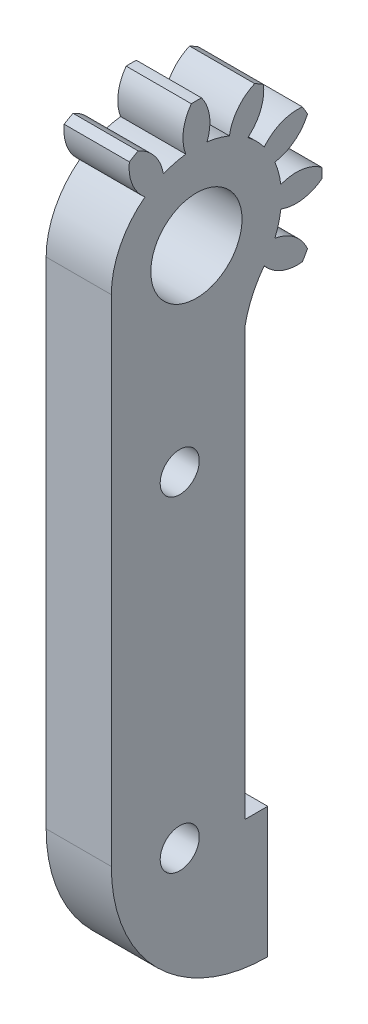
ISO-10303-21;
HEADER;
FILE_DESCRIPTION(('STEP AP214'),'2;1');
FILE_NAME('part.step','',(''),(''),'','','');
FILE_SCHEMA(('AUTOMOTIVE_DESIGN { 1 0 10303 214 1 1 1 1 }'));
ENDSEC;
DATA;
#1=APPLICATION_CONTEXT('core data for automotive mechanical design processes');
#2=APPLICATION_PROTOCOL_DEFINITION('international standard','automotive_design',2000,#1);
#3=PRODUCT_CONTEXT('',#1,'mechanical');
#4=PRODUCT('Part','Part','',(#3));
#5=PRODUCT_RELATED_PRODUCT_CATEGORY('part','',(#4));
#6=PRODUCT_DEFINITION_FORMATION('','',#4);
#7=PRODUCT_DEFINITION_CONTEXT('part definition',#1,'design');
#8=PRODUCT_DEFINITION('design','',#6,#7);
#9=PRODUCT_DEFINITION_SHAPE('','',#8);
#10=(LENGTH_UNIT() NAMED_UNIT(*) SI_UNIT(.MILLI.,.METRE.));
#11=(NAMED_UNIT(*) PLANE_ANGLE_UNIT() SI_UNIT($,.RADIAN.));
#12=(NAMED_UNIT(*) SI_UNIT($,.STERADIAN.) SOLID_ANGLE_UNIT());
#13=UNCERTAINTY_MEASURE_WITH_UNIT(LENGTH_MEASURE(1.E-05),#10,'distance_accuracy_value','');
#14=(GEOMETRIC_REPRESENTATION_CONTEXT(3) GLOBAL_UNCERTAINTY_ASSIGNED_CONTEXT((#13)) GLOBAL_UNIT_ASSIGNED_CONTEXT((#10,
#11,#12)) REPRESENTATION_CONTEXT('',''));
#15=CARTESIAN_POINT('',(0.,0.,0.));
#16=DIRECTION('',(0.,0.,1.));
#17=DIRECTION('',(1.,0.,0.));
#18=AXIS2_PLACEMENT_3D('',#15,#16,#17);
#19=CARTESIAN_POINT('',(5.,0.,0.));
#20=DIRECTION('',(-1.,0.,0.));
#21=DIRECTION('',(0.,-0.258819045102521,0.965925826289068));
#22=AXIS2_PLACEMENT_3D('',#19,#20,#21);
#23=CYLINDRICAL_SURFACE('',#22,6.53025);
#24=CARTESIAN_POINT('',(0.,0.,0.));
#25=DIRECTION('',(-1.,0.,0.));
#26=DIRECTION('',(0.,0.707106781186549,-0.707106781186546));
#27=AXIS2_PLACEMENT_3D('',#24,#25,#26);
#28=CIRCLE('',#27,6.53025);
#29=CARTESIAN_POINT('',(0.,0.,6.53025));
#30=VERTEX_POINT('',#29);
#31=CARTESIAN_POINT('',(0.,5.20307403430747,3.94616087558724));
#32=VERTEX_POINT('',#31);
#33=EDGE_CURVE('E249',#30,#32,#28,.T.);
#34=ORIENTED_EDGE('',*,*,#33,.F.);
#35=DIRECTION('',(1.,0.,0.));
#36=VECTOR('',#35,1.);
#37=CARTESIAN_POINT('',(-51.4198405287298,0.,6.53025));
#38=LINE('',#37,#36);
#39=CARTESIAN_POINT('',(5.,0.,6.53025));
#40=VERTEX_POINT('',#39);
#41=EDGE_CURVE('E235',#30,#40,#38,.T.);
#42=ORIENTED_EDGE('',*,*,#41,.T.);
#43=CARTESIAN_POINT('',(5.,0.,0.));
#44=DIRECTION('',(-1.,0.,0.));
#45=DIRECTION('',(0.,0.707106781186549,-0.707106781186546));
#46=AXIS2_PLACEMENT_3D('',#43,#44,#45);
#47=CIRCLE('',#46,6.53025);
#48=CARTESIAN_POINT('',(5.,5.20307403430747,3.94616087558724));
#49=VERTEX_POINT('',#48);
#50=EDGE_CURVE('E247',#40,#49,#47,.T.);
#51=ORIENTED_EDGE('',*,*,#50,.T.);
#52=DIRECTION('',(-1.,0.,0.));
#53=VECTOR('',#52,1.);
#54=CARTESIAN_POINT('',(5.,5.20307403430747,3.94616087558724));
#55=LINE('',#54,#53);
#56=EDGE_CURVE('E255',#49,#32,#55,.T.);
#57=ORIENTED_EDGE('',*,*,#56,.T.);
#58=EDGE_LOOP('',(#34,#42,#51,#57));
#59=FACE_BOUND('',#58,.T.);
#60=ADVANCED_FACE('F32',(#59),#23,.T.);
#61=CARTESIAN_POINT('',(5.,0.,0.));
#62=DIRECTION('',(-1.,0.,0.));
#63=DIRECTION('',(0.,-0.258819045102521,0.965925826289068));
#64=AXIS2_PLACEMENT_3D('',#61,#62,#63);
#65=PLANE('',#64);
#66=CARTESIAN_POINT('',(5.,-39.4107973671076,1.28025));
#67=DIRECTION('',(-1.,0.,0.));
#68=DIRECTION('',(0.,0.,1.));
#69=AXIS2_PLACEMENT_3D('',#66,#67,#68);
#70=CIRCLE('',#69,1.5);
#71=CARTESIAN_POINT('',(5.,-39.4107973671076,2.78025));
#72=VERTEX_POINT('',#71);
#73=EDGE_CURVE('E726',#72,#72,#70,.T.);
#74=ORIENTED_EDGE('',*,*,#73,.T.);
#75=EDGE_LOOP('',(#74));
#76=FACE_BOUND('',#75,.T.);
#77=CARTESIAN_POINT('',(5.,-14.4107973671076,1.28025));
#78=DIRECTION('',(-1.,0.,0.));
#79=DIRECTION('',(0.,0.,1.));
#80=AXIS2_PLACEMENT_3D('',#77,#78,#79);
#81=CIRCLE('',#80,1.50000000000002);
#82=CARTESIAN_POINT('',(5.,-14.4107973671076,2.78025000000002));
#83=VERTEX_POINT('',#82);
#84=EDGE_CURVE('E730',#83,#83,#81,.T.);
#85=ORIENTED_EDGE('',*,*,#84,.T.);
#86=EDGE_LOOP('',(#85));
#87=FACE_BOUND('',#86,.T.);
#88=CARTESIAN_POINT('',(5.,0.,0.));
#89=DIRECTION('',(1.,0.,0.));
#90=DIRECTION('',(0.,0.,-1.));
#91=AXIS2_PLACEMENT_3D('',#88,#89,#90);
#92=CIRCLE('',#91,3.5);
#93=CARTESIAN_POINT('',(5.,0.,-3.5));
#94=VERTEX_POINT('',#93);
#95=EDGE_CURVE('E732',#94,#94,#92,.T.);
#96=ORIENTED_EDGE('',*,*,#95,.F.);
#97=EDGE_LOOP('',(#96));
#98=FACE_BOUND('',#97,.T.);
#99=ORIENTED_EDGE('',*,*,#50,.F.);
#100=DIRECTION('',(0.,-1.,0.));
#101=VECTOR('',#100,1.);
#102=CARTESIAN_POINT('',(5.,0.,6.53025));
#103=LINE('',#102,#101);
#104=CARTESIAN_POINT('',(5.,-38.,6.53025));
#105=VERTEX_POINT('',#104);
#106=EDGE_CURVE('E231',#40,#105,#103,.T.);
#107=ORIENTED_EDGE('',*,*,#106,.T.);
#108=CARTESIAN_POINT('',(5.,-38.,-5.46975));
#109=DIRECTION('',(1.,0.,0.));
#110=DIRECTION('',(0.,0.,-1.));
#111=AXIS2_PLACEMENT_3D('',#108,#109,#110);
#112=CIRCLE('',#111,12.);
#113=CARTESIAN_POINT('',(5.,-50.,-5.46975));
#114=VERTEX_POINT('',#113);
#115=EDGE_CURVE('E243',#105,#114,#112,.T.);
#116=ORIENTED_EDGE('',*,*,#115,.T.);
#117=DIRECTION('',(0.,1.,0.));
#118=VECTOR('',#117,1.);
#119=CARTESIAN_POINT('',(5.,-50.,-5.46975));
#120=LINE('',#119,#118);
#121=CARTESIAN_POINT('',(5.,-40.,-5.46975));
#122=VERTEX_POINT('',#121);
#123=EDGE_CURVE('E750',#114,#122,#120,.T.);
#124=ORIENTED_EDGE('',*,*,#123,.T.);
#125=DIRECTION('',(0.,0.,1.));
#126=VECTOR('',#125,1.);
#127=CARTESIAN_POINT('',(5.,-40.,-5.46975));
#128=LINE('',#127,#126);
#129=CARTESIAN_POINT('',(5.,-40.,-3.71975));
#130=VERTEX_POINT('',#129);
#131=EDGE_CURVE('E753',#122,#130,#128,.T.);
#132=ORIENTED_EDGE('',*,*,#131,.T.);
#133=DIRECTION('',(0.,1.,0.));
#134=VECTOR('',#133,1.);
#135=CARTESIAN_POINT('',(5.,-40.,-3.71975));
#136=LINE('',#135,#134);
#137=CARTESIAN_POINT('',(5.,-7.27695193070972,-3.71975000000001));
#138=VERTEX_POINT('',#137);
#139=EDGE_CURVE('E756',#130,#138,#136,.T.);
#140=ORIENTED_EDGE('',*,*,#139,.T.);
#141=CARTESIAN_POINT('',(5.,-8.78047610160418,-11.5771932907617));
#142=DIRECTION('',(-1.,0.,0.));
#143=DIRECTION('',(0.,0.,-1.));
#144=AXIS2_PLACEMENT_3D('',#141,#142,#143);
#145=CIRCLE('',#144,8.);
#146=CARTESIAN_POINT('',(5.,-3.94616087558718,-5.20307403430751));
#147=VERTEX_POINT('',#146);
#148=EDGE_CURVE('E250',#138,#147,#145,.T.);
#149=ORIENTED_EDGE('',*,*,#148,.T.);
#150=CARTESIAN_POINT('',(5.,-1.86722961459183,-7.76589373379014));
#151=DIRECTION('',(-1.,0.,0.));
#152=DIRECTION('',(0.,-0.707106781186554,0.707106781186541));
#153=AXIS2_PLACEMENT_3D('',#150,#151,#152);
#154=CIRCLE('',#153,3.3);
#155=CARTESIAN_POINT('',(5.,-5.14670283362097,-8.13339258504088));
#156=VERTEX_POINT('',#155);
#157=EDGE_CURVE('E372',#156,#147,#154,.T.);
#158=ORIENTED_EDGE('',*,*,#157,.F.);
#159=CARTESIAN_POINT('',(5.,0.,0.));
#160=DIRECTION('',(-1.,0.,0.));
#161=DIRECTION('',(0.,-0.258819045102521,0.965925826289068));
#162=AXIS2_PLACEMENT_3D('',#159,#160,#161);
#163=CIRCLE('',#162,9.625);
#164=CARTESIAN_POINT('',(5.,-4.47037318078674,-8.52387169216564));
#165=VERTEX_POINT('',#164);
#166=EDGE_CURVE('E302',#165,#156,#163,.T.);
#167=ORIENTED_EDGE('',*,*,#166,.F.);
#168=CARTESIAN_POINT('',(5.,-5.79184644925663,-5.50001514783033));
#169=DIRECTION('',(-1.,0.,0.));
#170=DIRECTION('',(0.,-0.965925826289071,0.258819045102511));
#171=AXIS2_PLACEMENT_3D('',#168,#169,#170);
#172=CIRCLE('',#171,3.3);
#173=CARTESIAN_POINT('',(5.,-2.53291385368778,-6.01901258283255));
#174=VERTEX_POINT('',#173);
#175=EDGE_CURVE('E369',#174,#165,#172,.T.);
#176=ORIENTED_EDGE('',*,*,#175,.F.);
#177=CARTESIAN_POINT('',(5.,0.,0.));
#178=DIRECTION('',(-1.,0.,0.));
#179=DIRECTION('',(0.,-0.965925826289071,0.258819045102511));
#180=AXIS2_PLACEMENT_3D('',#177,#178,#179);
#181=CIRCLE('',#180,6.53025);
#182=CARTESIAN_POINT('',(5.,-0.815938548524985,-6.47907472927508));
#183=VERTEX_POINT('',#182);
#184=EDGE_CURVE('E457',#183,#174,#181,.T.);
#185=ORIENTED_EDGE('',*,*,#184,.F.);
#186=CARTESIAN_POINT('',(5.,2.26587858595993,-7.65907606384856));
#187=DIRECTION('',(-1.,0.,0.));
#188=DIRECTION('',(0.,-0.965925826289071,0.258819045102511));
#189=AXIS2_PLACEMENT_3D('',#186,#187,#188);
#190=CIRCLE('',#189,3.3);
#191=CARTESIAN_POINT('',(5.,-0.390479107124668,-9.61707601440787));
#192=VERTEX_POINT('',#191);
#193=EDGE_CURVE('E454',#192,#183,#190,.T.);
#194=ORIENTED_EDGE('',*,*,#193,.F.);
#195=CARTESIAN_POINT('',(5.,0.39047910712487,-9.61707601440786));
#196=VERTEX_POINT('',#195);
#197=EDGE_CURVE('E373',#196,#192,#163,.T.);
#198=ORIENTED_EDGE('',*,*,#197,.F.);
#199=CARTESIAN_POINT('',(5.,-2.26587858595977,-7.65907606384861));
#200=DIRECTION('',(-1.,0.,0.));
#201=DIRECTION('',(0.,-0.965925826289065,-0.258819045102531));
#202=AXIS2_PLACEMENT_3D('',#199,#200,#201);
#203=CIRCLE('',#202,3.3);
#204=CARTESIAN_POINT('',(5.,0.815938548525121,-6.47907472927507));
#205=VERTEX_POINT('',#204);
#206=EDGE_CURVE('E468',#205,#196,#203,.T.);
#207=ORIENTED_EDGE('',*,*,#206,.F.);
#208=CARTESIAN_POINT('',(5.,0.,0.));
#209=DIRECTION('',(-1.,0.,0.));
#210=DIRECTION('',(0.,-0.965925826289065,-0.258819045102531));
#211=AXIS2_PLACEMENT_3D('',#208,#209,#210);
#212=CIRCLE('',#211,6.53025);
#213=CARTESIAN_POINT('',(5.,2.53291385368791,-6.0190125828325));
#214=VERTEX_POINT('',#213);
#215=EDGE_CURVE('E473',#214,#205,#212,.T.);
#216=ORIENTED_EDGE('',*,*,#215,.F.);
#217=CARTESIAN_POINT('',(5.,5.79184644925675,-5.5000151478302));
#218=DIRECTION('',(-1.,0.,0.));
#219=DIRECTION('',(0.,-0.965925826289065,-0.258819045102531));
#220=AXIS2_PLACEMENT_3D('',#217,#218,#219);
#221=CIRCLE('',#220,3.3);
#222=CARTESIAN_POINT('',(5.,4.47037318078692,-8.52387169216555));
#223=VERTEX_POINT('',#222);
#224=EDGE_CURVE('E470',#223,#214,#221,.T.);
#225=ORIENTED_EDGE('',*,*,#224,.F.);
#226=CARTESIAN_POINT('',(5.,5.14670283362114,-8.13339258504077));
#227=VERTEX_POINT('',#226);
#228=EDGE_CURVE('E357',#227,#223,#163,.T.);
#229=ORIENTED_EDGE('',*,*,#228,.F.);
#230=CARTESIAN_POINT('',(5.,1.86722961459199,-7.7658937337901));
#231=DIRECTION('',(-1.,0.,0.));
#232=DIRECTION('',(0.,-0.707106781186539,-0.707106781186556));
#233=AXIS2_PLACEMENT_3D('',#230,#231,#232);
#234=CIRCLE('',#233,3.3);
#235=CARTESIAN_POINT('',(5.,3.9461608755873,-5.20307403430743));
#236=VERTEX_POINT('',#235);
#237=EDGE_CURVE('E395',#236,#227,#234,.T.);
#238=ORIENTED_EDGE('',*,*,#237,.F.);
#239=CARTESIAN_POINT('',(5.,0.,0.));
#240=DIRECTION('',(-1.,0.,0.));
#241=DIRECTION('',(0.,-0.707106781186539,-0.707106781186556));
#242=AXIS2_PLACEMENT_3D('',#239,#240,#241);
#243=CIRCLE('',#242,6.53025);
#244=CARTESIAN_POINT('',(5.,5.20307403430752,-3.94616087558717));
#245=VERTEX_POINT('',#244);
#246=EDGE_CURVE('E392',#245,#236,#243,.T.);
#247=ORIENTED_EDGE('',*,*,#246,.F.);
#248=CARTESIAN_POINT('',(5.,7.76589373379015,-1.8672296145918));
#249=DIRECTION('',(-1.,0.,0.));
#250=DIRECTION('',(0.,-0.707106781186539,-0.707106781186556));
#251=AXIS2_PLACEMENT_3D('',#248,#249,#250);
#252=CIRCLE('',#251,3.3);
#253=CARTESIAN_POINT('',(5.,8.13339258504089,-5.14670283362094));
#254=VERTEX_POINT('',#253);
#255=EDGE_CURVE('E390',#254,#245,#252,.T.);
#256=ORIENTED_EDGE('',*,*,#255,.F.);
#257=CARTESIAN_POINT('',(5.,8.52387169216565,-4.47037318078671));
#258=VERTEX_POINT('',#257);
#259=EDGE_CURVE('E301',#258,#254,#163,.T.);
#260=ORIENTED_EDGE('',*,*,#259,.F.);
#261=CARTESIAN_POINT('',(5.,5.50001514783035,-5.79184644925661));
#262=DIRECTION('',(-1.,0.,0.));
#263=DIRECTION('',(0.,-0.258819045102508,-0.965925826289072));
#264=AXIS2_PLACEMENT_3D('',#261,#262,#263);
#265=CIRCLE('',#264,3.3);
#266=CARTESIAN_POINT('',(5.,6.01901258283256,-2.53291385368776));
#267=VERTEX_POINT('',#266);
#268=EDGE_CURVE('E388',#267,#258,#265,.T.);
#269=ORIENTED_EDGE('',*,*,#268,.F.);
#270=CARTESIAN_POINT('',(5.,0.,0.));
#271=DIRECTION('',(-1.,0.,0.));
#272=DIRECTION('',(0.,-0.258819045102508,-0.965925826289072));
#273=AXIS2_PLACEMENT_3D('',#270,#271,#272);
#274=CIRCLE('',#273,6.53025);
#275=CARTESIAN_POINT('',(5.,6.47907472927509,-0.815938548524962));
#276=VERTEX_POINT('',#275);
#277=EDGE_CURVE('E422',#276,#267,#274,.T.);
#278=ORIENTED_EDGE('',*,*,#277,.F.);
#279=CARTESIAN_POINT('',(5.,7.65907606384855,2.26587858595996));
#280=DIRECTION('',(-1.,0.,0.));
#281=DIRECTION('',(0.,-0.258819045102508,-0.965925826289072));
#282=AXIS2_PLACEMENT_3D('',#279,#280,#281);
#283=CIRCLE('',#282,3.3);
#284=CARTESIAN_POINT('',(5.,9.61707601440787,-0.390479107124634));
#285=VERTEX_POINT('',#284);
#286=EDGE_CURVE('E415',#285,#276,#283,.T.);
#287=ORIENTED_EDGE('',*,*,#286,.F.);
#288=CARTESIAN_POINT('',(5.,9.61707601440787,0.39047910712477));
#289=VERTEX_POINT('',#288);
#290=EDGE_CURVE('E297',#289,#285,#163,.T.);
#291=ORIENTED_EDGE('',*,*,#290,.F.);
#292=CARTESIAN_POINT('',(5.,7.65907606384858,-2.26587858595985));
#293=DIRECTION('',(-1.,0.,0.));
#294=DIRECTION('',(0.,0.258819045102521,-0.965925826289068));
#295=AXIS2_PLACEMENT_3D('',#292,#293,#294);
#296=CIRCLE('',#295,3.3);
#297=CARTESIAN_POINT('',(5.,6.47907472927507,0.815938548525054));
#298=VERTEX_POINT('',#297);
#299=EDGE_CURVE('E269',#298,#289,#296,.T.);
#300=ORIENTED_EDGE('',*,*,#299,.F.);
#301=CARTESIAN_POINT('',(5.,0.,0.));
#302=DIRECTION('',(-1.,0.,0.));
#303=DIRECTION('',(0.,0.258819045102521,-0.965925826289068));
#304=AXIS2_PLACEMENT_3D('',#301,#302,#303);
#305=CIRCLE('',#304,6.53025);
#306=CARTESIAN_POINT('',(5.,6.01901258283252,2.53291385368785));
#307=VERTEX_POINT('',#306);
#308=EDGE_CURVE('E274',#307,#298,#305,.T.);
#309=ORIENTED_EDGE('',*,*,#308,.F.);
#310=CARTESIAN_POINT('',(5.,5.50001514783026,5.79184644925669));
#311=DIRECTION('',(-1.,0.,0.));
#312=DIRECTION('',(0.,0.258819045102521,-0.965925826289068));
#313=AXIS2_PLACEMENT_3D('',#310,#311,#312);
#314=CIRCLE('',#313,3.3);
#315=CARTESIAN_POINT('',(5.,8.52387169216559,4.47037318078683));
#316=VERTEX_POINT('',#315);
#317=EDGE_CURVE('E271',#316,#307,#314,.T.);
#318=ORIENTED_EDGE('',*,*,#317,.F.);
#319=CARTESIAN_POINT('',(5.,8.13339258504082,5.14670283362106));
#320=VERTEX_POINT('',#319);
#321=EDGE_CURVE('E294',#320,#316,#163,.T.);
#322=ORIENTED_EDGE('',*,*,#321,.F.);
#323=CARTESIAN_POINT('',(5.,7.76589373379012,1.86722961459191));
#324=DIRECTION('',(-1.,0.,0.));
#325=DIRECTION('',(0.,0.707106781186549,-0.707106781186546));
#326=AXIS2_PLACEMENT_3D('',#323,#324,#325);
#327=CIRCLE('',#326,3.3);
#328=EDGE_CURVE('E254',#49,#320,#327,.T.);
#329=ORIENTED_EDGE('',*,*,#328,.F.);
#330=EDGE_LOOP('',(#99,#107,#116,#124,#132,#140,#149,#158,#167,#176,#185,#194,#198,#207,#216,
#225,#229,#238,#247,#256,#260,#269,#278,#287,#291,#300,#309,#318,#322,#329));
#331=FACE_BOUND('',#330,.T.);
#332=ADVANCED_FACE('F34',(#76,#87,#98,#331),#65,.F.);
#333=CARTESIAN_POINT('',(0.,0.,0.));
#334=DIRECTION('',(1.,0.,0.));
#335=DIRECTION('',(0.,0.258819045102521,-0.965925826289068));
#336=AXIS2_PLACEMENT_3D('',#333,#334,#335);
#337=PLANE('',#336);
#338=CARTESIAN_POINT('',(0.,-39.4107973671076,1.28025));
#339=DIRECTION('',(-1.,0.,0.));
#340=DIRECTION('',(0.,0.,1.));
#341=AXIS2_PLACEMENT_3D('',#338,#339,#340);
#342=CIRCLE('',#341,1.5);
#343=CARTESIAN_POINT('',(0.,-39.4107973671076,2.78025));
#344=VERTEX_POINT('',#343);
#345=EDGE_CURVE('E729',#344,#344,#342,.T.);
#346=ORIENTED_EDGE('',*,*,#345,.F.);
#347=EDGE_LOOP('',(#346));
#348=FACE_BOUND('',#347,.T.);
#349=CARTESIAN_POINT('',(0.,-14.4107973671076,1.28025));
#350=DIRECTION('',(-1.,0.,0.));
#351=DIRECTION('',(0.,0.,1.));
#352=AXIS2_PLACEMENT_3D('',#349,#350,#351);
#353=CIRCLE('',#352,1.50000000000002);
#354=CARTESIAN_POINT('',(0.,-14.4107973671076,2.78025000000002));
#355=VERTEX_POINT('',#354);
#356=EDGE_CURVE('E735',#355,#355,#353,.T.);
#357=ORIENTED_EDGE('',*,*,#356,.F.);
#358=EDGE_LOOP('',(#357));
#359=FACE_BOUND('',#358,.T.);
#360=CARTESIAN_POINT('',(0.,0.,0.));
#361=DIRECTION('',(1.,0.,0.));
#362=DIRECTION('',(0.,0.,-1.));
#363=AXIS2_PLACEMENT_3D('',#360,#361,#362);
#364=CIRCLE('',#363,3.5);
#365=CARTESIAN_POINT('',(0.,0.,-3.5));
#366=VERTEX_POINT('',#365);
#367=EDGE_CURVE('E36',#366,#366,#364,.T.);
#368=ORIENTED_EDGE('',*,*,#367,.T.);
#369=EDGE_LOOP('',(#368));
#370=FACE_BOUND('',#369,.T.);
#371=CARTESIAN_POINT('',(0.,-1.86722961459183,-7.76589373379014));
#372=DIRECTION('',(1.,0.,0.));
#373=DIRECTION('',(0.,0.258819045102521,-0.965925826289068));
#374=AXIS2_PLACEMENT_3D('',#371,#372,#373);
#375=CIRCLE('',#374,3.3);
#376=CARTESIAN_POINT('',(0.,-3.94616087558719,-5.20307403430751));
#377=VERTEX_POINT('',#376);
#378=CARTESIAN_POINT('',(0.,-5.14670283362097,-8.13339258504088));
#379=VERTEX_POINT('',#378);
#380=EDGE_CURVE('E41',#377,#379,#375,.T.);
#381=ORIENTED_EDGE('',*,*,#380,.F.);
#382=CARTESIAN_POINT('',(0.,-8.78047610160418,-11.5771932907617));
#383=DIRECTION('',(1.,0.,0.));
#384=DIRECTION('',(0.,0.,-1.));
#385=AXIS2_PLACEMENT_3D('',#382,#383,#384);
#386=CIRCLE('',#385,8.);
#387=CARTESIAN_POINT('',(0.,-7.27695193070972,-3.71975));
#388=VERTEX_POINT('',#387);
#389=EDGE_CURVE('E445',#377,#388,#386,.T.);
#390=ORIENTED_EDGE('',*,*,#389,.T.);
#391=DIRECTION('',(0.,-1.,0.));
#392=VECTOR('',#391,1.);
#393=CARTESIAN_POINT('',(0.,-40.,-3.71975));
#394=LINE('',#393,#392);
#395=CARTESIAN_POINT('',(0.,-40.,-3.71975));
#396=VERTEX_POINT('',#395);
#397=EDGE_CURVE('E449',#388,#396,#394,.T.);
#398=ORIENTED_EDGE('',*,*,#397,.T.);
#399=DIRECTION('',(0.,0.,-1.));
#400=VECTOR('',#399,1.);
#401=CARTESIAN_POINT('',(0.,-40.,-5.46975));
#402=LINE('',#401,#400);
#403=CARTESIAN_POINT('',(0.,-40.,-5.46975));
#404=VERTEX_POINT('',#403);
#405=EDGE_CURVE('E746',#396,#404,#402,.T.);
#406=ORIENTED_EDGE('',*,*,#405,.T.);
#407=DIRECTION('',(0.,-1.,0.));
#408=VECTOR('',#407,1.);
#409=CARTESIAN_POINT('',(0.,-50.,-5.46975));
#410=LINE('',#409,#408);
#411=CARTESIAN_POINT('',(0.,-50.,-5.46975));
#412=VERTEX_POINT('',#411);
#413=EDGE_CURVE('E743',#404,#412,#410,.T.);
#414=ORIENTED_EDGE('',*,*,#413,.T.);
#415=CARTESIAN_POINT('',(0.,-38.,-5.46975));
#416=DIRECTION('',(1.,0.,0.));
#417=DIRECTION('',(0.,0.,-1.));
#418=AXIS2_PLACEMENT_3D('',#415,#416,#417);
#419=CIRCLE('',#418,12.);
#420=CARTESIAN_POINT('',(0.,-38.,6.53025));
#421=VERTEX_POINT('',#420);
#422=EDGE_CURVE('E443',#412,#421,#419,.F.);
#423=ORIENTED_EDGE('',*,*,#422,.T.);
#424=DIRECTION('',(0.,1.,0.));
#425=VECTOR('',#424,1.);
#426=CARTESIAN_POINT('',(0.,0.,6.53025));
#427=LINE('',#426,#425);
#428=EDGE_CURVE('E441',#421,#30,#427,.T.);
#429=ORIENTED_EDGE('',*,*,#428,.T.);
#430=ORIENTED_EDGE('',*,*,#33,.T.);
#431=CARTESIAN_POINT('',(0.,7.76589373379012,1.86722961459191));
#432=DIRECTION('',(-1.,0.,0.));
#433=DIRECTION('',(0.,0.707106781186549,-0.707106781186546));
#434=AXIS2_PLACEMENT_3D('',#431,#432,#433);
#435=CIRCLE('',#434,3.3);
#436=CARTESIAN_POINT('',(0.,8.13339258504082,5.14670283362106));
#437=VERTEX_POINT('',#436);
#438=EDGE_CURVE('E262',#32,#437,#435,.T.);
#439=ORIENTED_EDGE('',*,*,#438,.T.);
#440=CARTESIAN_POINT('',(0.,0.,0.));
#441=DIRECTION('',(-1.,0.,0.));
#442=DIRECTION('',(0.,-0.258819045102521,0.965925826289068));
#443=AXIS2_PLACEMENT_3D('',#440,#441,#442);
#444=CIRCLE('',#443,9.625);
#445=CARTESIAN_POINT('',(0.,8.52387169216559,4.47037318078683));
#446=VERTEX_POINT('',#445);
#447=EDGE_CURVE('E290',#437,#446,#444,.T.);
#448=ORIENTED_EDGE('',*,*,#447,.T.);
#449=CARTESIAN_POINT('',(0.,5.50001514783026,5.79184644925669));
#450=DIRECTION('',(1.,0.,0.));
#451=DIRECTION('',(0.,0.258819045102521,-0.965925826289068));
#452=AXIS2_PLACEMENT_3D('',#449,#450,#451);
#453=CIRCLE('',#452,3.3);
#454=CARTESIAN_POINT('',(0.,6.01901258283252,2.53291385368785));
#455=VERTEX_POINT('',#454);
#456=EDGE_CURVE('E300',#455,#446,#453,.T.);
#457=ORIENTED_EDGE('',*,*,#456,.F.);
#458=CARTESIAN_POINT('',(0.,0.,0.));
#459=DIRECTION('',(-1.,0.,0.));
#460=DIRECTION('',(0.,0.258819045102521,-0.965925826289068));
#461=AXIS2_PLACEMENT_3D('',#458,#459,#460);
#462=CIRCLE('',#461,6.53025);
#463=CARTESIAN_POINT('',(0.,6.47907472927507,0.815938548525054));
#464=VERTEX_POINT('',#463);
#465=EDGE_CURVE('E272',#455,#464,#462,.T.);
#466=ORIENTED_EDGE('',*,*,#465,.T.);
#467=CARTESIAN_POINT('',(0.,7.65907606384858,-2.26587858595985));
#468=DIRECTION('',(-1.,0.,0.));
#469=DIRECTION('',(0.,0.258819045102521,-0.965925826289068));
#470=AXIS2_PLACEMENT_3D('',#467,#468,#469);
#471=CIRCLE('',#470,3.3);
#472=CARTESIAN_POINT('',(0.,9.61707601440786,0.39047910712477));
#473=VERTEX_POINT('',#472);
#474=EDGE_CURVE('E268',#464,#473,#471,.T.);
#475=ORIENTED_EDGE('',*,*,#474,.T.);
#476=CARTESIAN_POINT('',(0.,9.61707601440787,-0.390479107124634));
#477=VERTEX_POINT('',#476);
#478=EDGE_CURVE('E291',#473,#477,#444,.T.);
#479=ORIENTED_EDGE('',*,*,#478,.T.);
#480=CARTESIAN_POINT('',(0.,7.65907606384855,2.26587858595996));
#481=DIRECTION('',(1.,0.,0.));
#482=DIRECTION('',(0.,0.258819045102521,-0.965925826289068));
#483=AXIS2_PLACEMENT_3D('',#480,#481,#482);
#484=CIRCLE('',#483,3.3);
#485=CARTESIAN_POINT('',(0.,6.47907472927509,-0.815938548524962));
#486=VERTEX_POINT('',#485);
#487=EDGE_CURVE('E307',#486,#477,#484,.T.);
#488=ORIENTED_EDGE('',*,*,#487,.F.);
#489=CARTESIAN_POINT('',(0.,0.,0.));
#490=DIRECTION('',(-1.,0.,0.));
#491=DIRECTION('',(0.,-0.258819045102508,-0.965925826289072));
#492=AXIS2_PLACEMENT_3D('',#489,#490,#491);
#493=CIRCLE('',#492,6.53025);
#494=CARTESIAN_POINT('',(0.,6.01901258283256,-2.53291385368776));
#495=VERTEX_POINT('',#494);
#496=EDGE_CURVE('E447',#486,#495,#493,.T.);
#497=ORIENTED_EDGE('',*,*,#496,.T.);
#498=CARTESIAN_POINT('',(0.,5.50001514783035,-5.79184644925661));
#499=DIRECTION('',(-1.,0.,0.));
#500=DIRECTION('',(0.,-0.258819045102508,-0.965925826289072));
#501=AXIS2_PLACEMENT_3D('',#498,#499,#500);
#502=CIRCLE('',#501,3.3);
#503=CARTESIAN_POINT('',(0.,8.52387169216565,-4.47037318078671));
#504=VERTEX_POINT('',#503);
#505=EDGE_CURVE('E444',#495,#504,#502,.T.);
#506=ORIENTED_EDGE('',*,*,#505,.T.);
#507=CARTESIAN_POINT('',(0.,8.13339258504089,-5.14670283362094));
#508=VERTEX_POINT('',#507);
#509=EDGE_CURVE('E295',#504,#508,#444,.T.);
#510=ORIENTED_EDGE('',*,*,#509,.T.);
#511=CARTESIAN_POINT('',(0.,7.76589373379015,-1.8672296145918));
#512=DIRECTION('',(1.,0.,0.));
#513=DIRECTION('',(0.,0.258819045102521,-0.965925826289068));
#514=AXIS2_PLACEMENT_3D('',#511,#512,#513);
#515=CIRCLE('',#514,3.3);
#516=CARTESIAN_POINT('',(0.,5.20307403430752,-3.94616087558717));
#517=VERTEX_POINT('',#516);
#518=EDGE_CURVE('E305',#517,#508,#515,.T.);
#519=ORIENTED_EDGE('',*,*,#518,.F.);
#520=CARTESIAN_POINT('',(0.,0.,0.));
#521=DIRECTION('',(-1.,0.,0.));
#522=DIRECTION('',(0.,-0.707106781186539,-0.707106781186556));
#523=AXIS2_PLACEMENT_3D('',#520,#521,#522);
#524=CIRCLE('',#523,6.53025);
#525=CARTESIAN_POINT('',(0.,3.9461608755873,-5.20307403430743));
#526=VERTEX_POINT('',#525);
#527=EDGE_CURVE('E399',#517,#526,#524,.T.);
#528=ORIENTED_EDGE('',*,*,#527,.T.);
#529=CARTESIAN_POINT('',(0.,1.86722961459199,-7.7658937337901));
#530=DIRECTION('',(-1.,0.,0.));
#531=DIRECTION('',(0.,-0.707106781186539,-0.707106781186556));
#532=AXIS2_PLACEMENT_3D('',#529,#530,#531);
#533=CIRCLE('',#532,3.3);
#534=CARTESIAN_POINT('',(0.,5.14670283362114,-8.13339258504076));
#535=VERTEX_POINT('',#534);
#536=EDGE_CURVE('E348',#526,#535,#533,.T.);
#537=ORIENTED_EDGE('',*,*,#536,.T.);
#538=CARTESIAN_POINT('',(0.,4.47037318078692,-8.52387169216555));
#539=VERTEX_POINT('',#538);
#540=EDGE_CURVE('E335',#535,#539,#444,.T.);
#541=ORIENTED_EDGE('',*,*,#540,.T.);
#542=CARTESIAN_POINT('',(0.,5.79184644925675,-5.5000151478302));
#543=DIRECTION('',(1.,0.,0.));
#544=DIRECTION('',(0.,0.258819045102521,-0.965925826289068));
#545=AXIS2_PLACEMENT_3D('',#542,#543,#544);
#546=CIRCLE('',#545,3.3);
#547=CARTESIAN_POINT('',(0.,2.53291385368791,-6.0190125828325));
#548=VERTEX_POINT('',#547);
#549=EDGE_CURVE('E309',#548,#539,#546,.T.);
#550=ORIENTED_EDGE('',*,*,#549,.F.);
#551=CARTESIAN_POINT('',(0.,0.,0.));
#552=DIRECTION('',(-1.,0.,0.));
#553=DIRECTION('',(0.,-0.965925826289065,-0.258819045102531));
#554=AXIS2_PLACEMENT_3D('',#551,#552,#553);
#555=CIRCLE('',#554,6.53025);
#556=CARTESIAN_POINT('',(0.,0.815938548525121,-6.47907472927507));
#557=VERTEX_POINT('',#556);
#558=EDGE_CURVE('E471',#548,#557,#555,.T.);
#559=ORIENTED_EDGE('',*,*,#558,.T.);
#560=CARTESIAN_POINT('',(0.,-2.26587858595977,-7.65907606384861));
#561=DIRECTION('',(-1.,0.,0.));
#562=DIRECTION('',(0.,-0.965925826289065,-0.258819045102531));
#563=AXIS2_PLACEMENT_3D('',#560,#561,#562);
#564=CIRCLE('',#563,3.3);
#565=CARTESIAN_POINT('',(0.,0.390479107124871,-9.61707601440786));
#566=VERTEX_POINT('',#565);
#567=EDGE_CURVE('E56',#557,#566,#564,.T.);
#568=ORIENTED_EDGE('',*,*,#567,.T.);
#569=CARTESIAN_POINT('',(0.,-0.390479107124669,-9.61707601440787));
#570=VERTEX_POINT('',#569);
#571=EDGE_CURVE('E333',#566,#570,#444,.T.);
#572=ORIENTED_EDGE('',*,*,#571,.T.);
#573=CARTESIAN_POINT('',(0.,2.26587858595993,-7.65907606384856));
#574=DIRECTION('',(1.,0.,0.));
#575=DIRECTION('',(0.,0.258819045102521,-0.965925826289068));
#576=AXIS2_PLACEMENT_3D('',#573,#574,#575);
#577=CIRCLE('',#576,3.3);
#578=CARTESIAN_POINT('',(0.,-0.815938548524985,-6.47907472927508));
#579=VERTEX_POINT('',#578);
#580=EDGE_CURVE('E11',#579,#570,#577,.T.);
#581=ORIENTED_EDGE('',*,*,#580,.F.);
#582=CARTESIAN_POINT('',(0.,0.,0.));
#583=DIRECTION('',(-1.,0.,0.));
#584=DIRECTION('',(0.,-0.965925826289071,0.258819045102511));
#585=AXIS2_PLACEMENT_3D('',#582,#583,#584);
#586=CIRCLE('',#585,6.53025);
#587=CARTESIAN_POINT('',(0.,-2.53291385368778,-6.01901258283255));
#588=VERTEX_POINT('',#587);
#589=EDGE_CURVE('E455',#579,#588,#586,.T.);
#590=ORIENTED_EDGE('',*,*,#589,.T.);
#591=CARTESIAN_POINT('',(0.,-5.79184644925663,-5.50001514783033));
#592=DIRECTION('',(-1.,0.,0.));
#593=DIRECTION('',(0.,-0.965925826289071,0.258819045102511));
#594=AXIS2_PLACEMENT_3D('',#591,#592,#593);
#595=CIRCLE('',#594,3.3);
#596=CARTESIAN_POINT('',(0.,-4.47037318078674,-8.52387169216564));
#597=VERTEX_POINT('',#596);
#598=EDGE_CURVE('E48',#588,#597,#595,.T.);
#599=ORIENTED_EDGE('',*,*,#598,.T.);
#600=EDGE_CURVE('E296',#597,#379,#444,.T.);
#601=ORIENTED_EDGE('',*,*,#600,.T.);
#602=EDGE_LOOP('',(#381,#390,#398,#406,#414,#423,#429,#430,#439,#448,#457,#466,#475,#479,#488,
#497,#506,#510,#519,#528,#537,#541,#550,#559,#568,#572,#581,#590,#599,#601));
#603=FACE_BOUND('',#602,.T.);
#604=ADVANCED_FACE('F331',(#348,#359,#370,#603),#337,.F.);
#605=CARTESIAN_POINT('',(-10.,0.,0.));
#606=DIRECTION('',(-1.,0.,0.));
#607=DIRECTION('',(0.,-0.258819045102521,0.965925826289068));
#608=AXIS2_PLACEMENT_3D('',#605,#606,#607);
#609=CYLINDRICAL_SURFACE('',#608,9.625);
#610=DIRECTION('',(-1.,0.,0.));
#611=VECTOR('',#610,1.);
#612=CARTESIAN_POINT('',(2.5,-4.47037318078674,-8.52387169216564));
#613=LINE('',#612,#611);
#614=EDGE_CURVE('E265',#165,#597,#613,.T.);
#615=ORIENTED_EDGE('',*,*,#614,.F.);
#616=ORIENTED_EDGE('',*,*,#166,.T.);
#617=DIRECTION('',(-1.,0.,0.));
#618=VECTOR('',#617,1.);
#619=CARTESIAN_POINT('',(2.5,-5.14670283362097,-8.13339258504088));
#620=LINE('',#619,#618);
#621=EDGE_CURVE('E317',#379,#156,#620,.F.);
#622=ORIENTED_EDGE('',*,*,#621,.F.);
#623=ORIENTED_EDGE('',*,*,#600,.F.);
#624=EDGE_LOOP('',(#615,#616,#622,#623));
#625=FACE_BOUND('',#624,.T.);
#626=ADVANCED_FACE('F326',(#625),#609,.T.);
#627=DIRECTION('',(-1.,0.,0.));
#628=VECTOR('',#627,1.);
#629=CARTESIAN_POINT('',(2.5,-0.39047910712467,-9.61707601440787));
#630=LINE('',#629,#628);
#631=EDGE_CURVE('E328',#570,#192,#630,.F.);
#632=ORIENTED_EDGE('',*,*,#631,.F.);
#633=ORIENTED_EDGE('',*,*,#571,.F.);
#634=DIRECTION('',(-1.,0.,0.));
#635=VECTOR('',#634,1.);
#636=CARTESIAN_POINT('',(2.5,0.390479107124871,-9.61707601440786));
#637=LINE('',#636,#635);
#638=EDGE_CURVE('E329',#196,#566,#637,.T.);
#639=ORIENTED_EDGE('',*,*,#638,.F.);
#640=ORIENTED_EDGE('',*,*,#197,.T.);
#641=EDGE_LOOP('',(#632,#633,#639,#640));
#642=FACE_BOUND('',#641,.T.);
#643=ADVANCED_FACE('F528',(#642),#609,.T.);
#644=DIRECTION('',(-1.,0.,0.));
#645=VECTOR('',#644,1.);
#646=CARTESIAN_POINT('',(2.5,4.47037318078692,-8.52387169216555));
#647=LINE('',#646,#645);
#648=EDGE_CURVE('E356',#539,#223,#647,.F.);
#649=ORIENTED_EDGE('',*,*,#648,.F.);
#650=ORIENTED_EDGE('',*,*,#540,.F.);
#651=DIRECTION('',(-1.,0.,0.));
#652=VECTOR('',#651,1.);
#653=CARTESIAN_POINT('',(2.5,5.14670283362114,-8.13339258504076));
#654=LINE('',#653,#652);
#655=EDGE_CURVE('E354',#227,#535,#654,.T.);
#656=ORIENTED_EDGE('',*,*,#655,.F.);
#657=ORIENTED_EDGE('',*,*,#228,.T.);
#658=EDGE_LOOP('',(#649,#650,#656,#657));
#659=FACE_BOUND('',#658,.T.);
#660=ADVANCED_FACE('F352',(#659),#609,.T.);
#661=DIRECTION('',(-1.,0.,0.));
#662=VECTOR('',#661,1.);
#663=CARTESIAN_POINT('',(2.5,8.52387169216565,-4.47037318078671));
#664=LINE('',#663,#662);
#665=EDGE_CURVE('E360',#258,#504,#664,.T.);
#666=ORIENTED_EDGE('',*,*,#665,.F.);
#667=ORIENTED_EDGE('',*,*,#259,.T.);
#668=DIRECTION('',(-1.,0.,0.));
#669=VECTOR('',#668,1.);
#670=CARTESIAN_POINT('',(2.5,8.13339258504089,-5.14670283362094));
#671=LINE('',#670,#669);
#672=EDGE_CURVE('E384',#508,#254,#671,.F.);
#673=ORIENTED_EDGE('',*,*,#672,.F.);
#674=ORIENTED_EDGE('',*,*,#509,.F.);
#675=EDGE_LOOP('',(#666,#667,#673,#674));
#676=FACE_BOUND('',#675,.T.);
#677=ADVANCED_FACE('F383',(#676),#609,.T.);
#678=DIRECTION('',(-1.,0.,0.));
#679=VECTOR('',#678,1.);
#680=CARTESIAN_POINT('',(2.5,9.61707601440787,-0.390479107124634));
#681=LINE('',#680,#679);
#682=EDGE_CURVE('E363',#477,#285,#681,.F.);
#683=ORIENTED_EDGE('',*,*,#682,.F.);
#684=ORIENTED_EDGE('',*,*,#478,.F.);
#685=DIRECTION('',(-1.,0.,0.));
#686=VECTOR('',#685,1.);
#687=CARTESIAN_POINT('',(2.5,9.61707601440786,0.39047910712477));
#688=LINE('',#687,#686);
#689=EDGE_CURVE('E288',#289,#473,#688,.T.);
#690=ORIENTED_EDGE('',*,*,#689,.F.);
#691=ORIENTED_EDGE('',*,*,#290,.T.);
#692=EDGE_LOOP('',(#683,#684,#690,#691));
#693=FACE_BOUND('',#692,.T.);
#694=ADVANCED_FACE('F425',(#693),#609,.T.);
#695=DIRECTION('',(-1.,0.,0.));
#696=VECTOR('',#695,1.);
#697=CARTESIAN_POINT('',(2.5,8.13339258504082,5.14670283362106));
#698=LINE('',#697,#696);
#699=EDGE_CURVE('E257',#320,#437,#698,.T.);
#700=ORIENTED_EDGE('',*,*,#699,.F.);
#701=ORIENTED_EDGE('',*,*,#321,.T.);
#702=DIRECTION('',(-1.,0.,0.));
#703=VECTOR('',#702,1.);
#704=CARTESIAN_POINT('',(2.5,8.52387169216559,4.47037318078683));
#705=LINE('',#704,#703);
#706=EDGE_CURVE('E285',#446,#316,#705,.F.);
#707=ORIENTED_EDGE('',*,*,#706,.F.);
#708=ORIENTED_EDGE('',*,*,#447,.F.);
#709=EDGE_LOOP('',(#700,#701,#707,#708));
#710=FACE_BOUND('',#709,.T.);
#711=ADVANCED_FACE('F437',(#710),#609,.T.);
#712=CARTESIAN_POINT('',(5.,7.65907606384858,-2.26587858595985));
#713=DIRECTION('',(-1.,0.,0.));
#714=DIRECTION('',(0.,-0.258819045102521,0.965925826289068));
#715=AXIS2_PLACEMENT_3D('',#712,#713,#714);
#716=CYLINDRICAL_SURFACE('',#715,3.3);
#717=ORIENTED_EDGE('',*,*,#689,.T.);
#718=ORIENTED_EDGE('',*,*,#474,.F.);
#719=DIRECTION('',(-1.,0.,0.));
#720=VECTOR('',#719,1.);
#721=CARTESIAN_POINT('',(5.,6.47907472927507,0.815938548525054));
#722=LINE('',#721,#720);
#723=EDGE_CURVE('E276',#298,#464,#722,.T.);
#724=ORIENTED_EDGE('',*,*,#723,.F.);
#725=ORIENTED_EDGE('',*,*,#299,.T.);
#726=EDGE_LOOP('',(#717,#718,#724,#725));
#727=FACE_BOUND('',#726,.T.);
#728=ADVANCED_FACE('F427',(#727),#716,.T.);
#729=CARTESIAN_POINT('',(5.,5.50001514783026,5.79184644925669));
#730=DIRECTION('',(-1.,0.,0.));
#731=DIRECTION('',(0.,-0.258819045102521,0.965925826289068));
#732=AXIS2_PLACEMENT_3D('',#729,#730,#731);
#733=CYLINDRICAL_SURFACE('',#732,3.3);
#734=ORIENTED_EDGE('',*,*,#706,.T.);
#735=ORIENTED_EDGE('',*,*,#317,.T.);
#736=DIRECTION('',(-1.,0.,0.));
#737=VECTOR('',#736,1.);
#738=CARTESIAN_POINT('',(5.,6.01901258283252,2.53291385368785));
#739=LINE('',#738,#737);
#740=EDGE_CURVE('E283',#307,#455,#739,.T.);
#741=ORIENTED_EDGE('',*,*,#740,.T.);
#742=ORIENTED_EDGE('',*,*,#456,.T.);
#743=EDGE_LOOP('',(#734,#735,#741,#742));
#744=FACE_BOUND('',#743,.T.);
#745=ADVANCED_FACE('F436',(#744),#733,.T.);
#746=CARTESIAN_POINT('',(5.,0.,0.));
#747=DIRECTION('',(-1.,0.,0.));
#748=DIRECTION('',(0.,-0.258819045102521,0.965925826289068));
#749=AXIS2_PLACEMENT_3D('',#746,#747,#748);
#750=CYLINDRICAL_SURFACE('',#749,6.53025);
#751=ORIENTED_EDGE('',*,*,#465,.F.);
#752=ORIENTED_EDGE('',*,*,#740,.F.);
#753=ORIENTED_EDGE('',*,*,#308,.T.);
#754=ORIENTED_EDGE('',*,*,#723,.T.);
#755=EDGE_LOOP('',(#751,#752,#753,#754));
#756=FACE_BOUND('',#755,.T.);
#757=ADVANCED_FACE('F432',(#756),#750,.T.);
#758=CARTESIAN_POINT('',(5.,7.76589373379012,1.86722961459191));
#759=DIRECTION('',(-1.,0.,0.));
#760=DIRECTION('',(0.,-0.258819045102521,0.965925826289068));
#761=AXIS2_PLACEMENT_3D('',#758,#759,#760);
#762=CYLINDRICAL_SURFACE('',#761,3.3);
#763=ORIENTED_EDGE('',*,*,#699,.T.);
#764=ORIENTED_EDGE('',*,*,#438,.F.);
#765=ORIENTED_EDGE('',*,*,#56,.F.);
#766=ORIENTED_EDGE('',*,*,#328,.T.);
#767=EDGE_LOOP('',(#763,#764,#765,#766));
#768=FACE_BOUND('',#767,.T.);
#769=ADVANCED_FACE('F440',(#768),#762,.T.);
#770=CARTESIAN_POINT('',(5.,1.86722961459199,-7.7658937337901));
#771=DIRECTION('',(-1.,0.,0.));
#772=DIRECTION('',(0.,-0.258819045102521,0.965925826289068));
#773=AXIS2_PLACEMENT_3D('',#770,#771,#772);
#774=CYLINDRICAL_SURFACE('',#773,3.3);
#775=ORIENTED_EDGE('',*,*,#655,.T.);
#776=ORIENTED_EDGE('',*,*,#536,.F.);
#777=DIRECTION('',(-1.,0.,0.));
#778=VECTOR('',#777,1.);
#779=CARTESIAN_POINT('',(5.,3.9461608755873,-5.20307403430743));
#780=LINE('',#779,#778);
#781=EDGE_CURVE('E397',#236,#526,#780,.T.);
#782=ORIENTED_EDGE('',*,*,#781,.F.);
#783=ORIENTED_EDGE('',*,*,#237,.T.);
#784=EDGE_LOOP('',(#775,#776,#782,#783));
#785=FACE_BOUND('',#784,.T.);
#786=ADVANCED_FACE('F511',(#785),#774,.T.);
#787=CARTESIAN_POINT('',(5.,7.76589373379015,-1.8672296145918));
#788=DIRECTION('',(-1.,0.,0.));
#789=DIRECTION('',(0.,-0.258819045102521,0.965925826289068));
#790=AXIS2_PLACEMENT_3D('',#787,#788,#789);
#791=CYLINDRICAL_SURFACE('',#790,3.3);
#792=ORIENTED_EDGE('',*,*,#672,.T.);
#793=ORIENTED_EDGE('',*,*,#255,.T.);
#794=DIRECTION('',(-1.,0.,0.));
#795=VECTOR('',#794,1.);
#796=CARTESIAN_POINT('',(5.,5.20307403430752,-3.94616087558717));
#797=LINE('',#796,#795);
#798=EDGE_CURVE('E408',#245,#517,#797,.T.);
#799=ORIENTED_EDGE('',*,*,#798,.T.);
#800=ORIENTED_EDGE('',*,*,#518,.T.);
#801=EDGE_LOOP('',(#792,#793,#799,#800));
#802=FACE_BOUND('',#801,.T.);
#803=ADVANCED_FACE('F500',(#802),#791,.T.);
#804=CARTESIAN_POINT('',(5.,0.,0.));
#805=DIRECTION('',(-1.,0.,0.));
#806=DIRECTION('',(0.,-0.258819045102521,0.965925826289068));
#807=AXIS2_PLACEMENT_3D('',#804,#805,#806);
#808=CYLINDRICAL_SURFACE('',#807,6.53025);
#809=ORIENTED_EDGE('',*,*,#527,.F.);
#810=ORIENTED_EDGE('',*,*,#798,.F.);
#811=ORIENTED_EDGE('',*,*,#246,.T.);
#812=ORIENTED_EDGE('',*,*,#781,.T.);
#813=EDGE_LOOP('',(#809,#810,#811,#812));
#814=FACE_BOUND('',#813,.T.);
#815=ADVANCED_FACE('F493',(#814),#808,.T.);
#816=CARTESIAN_POINT('',(5.,5.50001514783035,-5.79184644925661));
#817=DIRECTION('',(-1.,0.,0.));
#818=DIRECTION('',(0.,-0.258819045102521,0.965925826289068));
#819=AXIS2_PLACEMENT_3D('',#816,#817,#818);
#820=CYLINDRICAL_SURFACE('',#819,3.3);
#821=ORIENTED_EDGE('',*,*,#665,.T.);
#822=ORIENTED_EDGE('',*,*,#505,.F.);
#823=DIRECTION('',(-1.,0.,0.));
#824=VECTOR('',#823,1.);
#825=CARTESIAN_POINT('',(5.,6.01901258283256,-2.53291385368776));
#826=LINE('',#825,#824);
#827=EDGE_CURVE('E481',#267,#495,#826,.T.);
#828=ORIENTED_EDGE('',*,*,#827,.F.);
#829=ORIENTED_EDGE('',*,*,#268,.T.);
#830=EDGE_LOOP('',(#821,#822,#828,#829));
#831=FACE_BOUND('',#830,.T.);
#832=ADVANCED_FACE('F491',(#831),#820,.T.);
#833=CARTESIAN_POINT('',(5.,7.65907606384855,2.26587858595996));
#834=DIRECTION('',(-1.,0.,0.));
#835=DIRECTION('',(0.,-0.258819045102521,0.965925826289068));
#836=AXIS2_PLACEMENT_3D('',#833,#834,#835);
#837=CYLINDRICAL_SURFACE('',#836,3.3);
#838=ORIENTED_EDGE('',*,*,#682,.T.);
#839=ORIENTED_EDGE('',*,*,#286,.T.);
#840=DIRECTION('',(-1.,0.,0.));
#841=VECTOR('',#840,1.);
#842=CARTESIAN_POINT('',(5.,6.47907472927509,-0.815938548524962));
#843=LINE('',#842,#841);
#844=EDGE_CURVE('E404',#276,#486,#843,.T.);
#845=ORIENTED_EDGE('',*,*,#844,.T.);
#846=ORIENTED_EDGE('',*,*,#487,.T.);
#847=EDGE_LOOP('',(#838,#839,#845,#846));
#848=FACE_BOUND('',#847,.T.);
#849=ADVANCED_FACE('F414',(#848),#837,.T.);
#850=CARTESIAN_POINT('',(5.,0.,0.));
#851=DIRECTION('',(-1.,0.,0.));
#852=DIRECTION('',(0.,-0.258819045102521,0.965925826289068));
#853=AXIS2_PLACEMENT_3D('',#850,#851,#852);
#854=CYLINDRICAL_SURFACE('',#853,6.53025);
#855=ORIENTED_EDGE('',*,*,#496,.F.);
#856=ORIENTED_EDGE('',*,*,#844,.F.);
#857=ORIENTED_EDGE('',*,*,#277,.T.);
#858=ORIENTED_EDGE('',*,*,#827,.T.);
#859=EDGE_LOOP('',(#855,#856,#857,#858));
#860=FACE_BOUND('',#859,.T.);
#861=ADVANCED_FACE('F488',(#860),#854,.T.);
#862=CARTESIAN_POINT('',(5.,-2.26587858595977,-7.65907606384861));
#863=DIRECTION('',(-1.,0.,0.));
#864=DIRECTION('',(0.,-0.258819045102521,0.965925826289068));
#865=AXIS2_PLACEMENT_3D('',#862,#863,#864);
#866=CYLINDRICAL_SURFACE('',#865,3.3);
#867=ORIENTED_EDGE('',*,*,#638,.T.);
#868=ORIENTED_EDGE('',*,*,#567,.F.);
#869=DIRECTION('',(-1.,0.,0.));
#870=VECTOR('',#869,1.);
#871=CARTESIAN_POINT('',(5.,0.815938548525121,-6.47907472927507));
#872=LINE('',#871,#870);
#873=EDGE_CURVE('E475',#205,#557,#872,.T.);
#874=ORIENTED_EDGE('',*,*,#873,.F.);
#875=ORIENTED_EDGE('',*,*,#206,.T.);
#876=EDGE_LOOP('',(#867,#868,#874,#875));
#877=FACE_BOUND('',#876,.T.);
#878=ADVANCED_FACE('F549',(#877),#866,.T.);
#879=CARTESIAN_POINT('',(5.,5.79184644925675,-5.5000151478302));
#880=DIRECTION('',(-1.,0.,0.));
#881=DIRECTION('',(0.,-0.258819045102521,0.965925826289068));
#882=AXIS2_PLACEMENT_3D('',#879,#880,#881);
#883=CYLINDRICAL_SURFACE('',#882,3.3);
#884=ORIENTED_EDGE('',*,*,#648,.T.);
#885=ORIENTED_EDGE('',*,*,#224,.T.);
#886=DIRECTION('',(-1.,0.,0.));
#887=VECTOR('',#886,1.);
#888=CARTESIAN_POINT('',(5.,2.53291385368791,-6.0190125828325));
#889=LINE('',#888,#887);
#890=EDGE_CURVE('E461',#214,#548,#889,.T.);
#891=ORIENTED_EDGE('',*,*,#890,.T.);
#892=ORIENTED_EDGE('',*,*,#549,.T.);
#893=EDGE_LOOP('',(#884,#885,#891,#892));
#894=FACE_BOUND('',#893,.T.);
#895=ADVANCED_FACE('F575',(#894),#883,.T.);
#896=CARTESIAN_POINT('',(5.,0.,0.));
#897=DIRECTION('',(-1.,0.,0.));
#898=DIRECTION('',(0.,-0.258819045102521,0.965925826289068));
#899=AXIS2_PLACEMENT_3D('',#896,#897,#898);
#900=CYLINDRICAL_SURFACE('',#899,6.53025);
#901=ORIENTED_EDGE('',*,*,#558,.F.);
#902=ORIENTED_EDGE('',*,*,#890,.F.);
#903=ORIENTED_EDGE('',*,*,#215,.T.);
#904=ORIENTED_EDGE('',*,*,#873,.T.);
#905=EDGE_LOOP('',(#901,#902,#903,#904));
#906=FACE_BOUND('',#905,.T.);
#907=ADVANCED_FACE('F546',(#906),#900,.T.);
#908=CARTESIAN_POINT('',(5.,-1.86722961459183,-7.76589373379014));
#909=DIRECTION('',(-1.,0.,0.));
#910=DIRECTION('',(0.,-0.258819045102521,0.965925826289068));
#911=AXIS2_PLACEMENT_3D('',#908,#909,#910);
#912=CYLINDRICAL_SURFACE('',#911,3.3);
#913=ORIENTED_EDGE('',*,*,#621,.T.);
#914=ORIENTED_EDGE('',*,*,#157,.T.);
#915=DIRECTION('',(-1.,0.,0.));
#916=VECTOR('',#915,1.);
#917=CARTESIAN_POINT('',(5.,-3.94616087558719,-5.20307403430751));
#918=LINE('',#917,#916);
#919=EDGE_CURVE('E319',#147,#377,#918,.T.);
#920=ORIENTED_EDGE('',*,*,#919,.T.);
#921=ORIENTED_EDGE('',*,*,#380,.T.);
#922=EDGE_LOOP('',(#913,#914,#920,#921));
#923=FACE_BOUND('',#922,.T.);
#924=ADVANCED_FACE('F315',(#923),#912,.T.);
#925=CARTESIAN_POINT('',(5.,-5.79184644925663,-5.50001514783033));
#926=DIRECTION('',(-1.,0.,0.));
#927=DIRECTION('',(0.,-0.258819045102521,0.965925826289068));
#928=AXIS2_PLACEMENT_3D('',#925,#926,#927);
#929=CYLINDRICAL_SURFACE('',#928,3.3);
#930=ORIENTED_EDGE('',*,*,#614,.T.);
#931=ORIENTED_EDGE('',*,*,#598,.F.);
#932=DIRECTION('',(-1.,0.,0.));
#933=VECTOR('',#932,1.);
#934=CARTESIAN_POINT('',(5.,-2.53291385368778,-6.01901258283255));
#935=LINE('',#934,#933);
#936=EDGE_CURVE('E459',#174,#588,#935,.T.);
#937=ORIENTED_EDGE('',*,*,#936,.F.);
#938=ORIENTED_EDGE('',*,*,#175,.T.);
#939=EDGE_LOOP('',(#930,#931,#937,#938));
#940=FACE_BOUND('',#939,.T.);
#941=ADVANCED_FACE('F367',(#940),#929,.T.);
#942=CARTESIAN_POINT('',(5.,2.26587858595993,-7.65907606384856));
#943=DIRECTION('',(-1.,0.,0.));
#944=DIRECTION('',(0.,-0.258819045102521,0.965925826289068));
#945=AXIS2_PLACEMENT_3D('',#942,#943,#944);
#946=CYLINDRICAL_SURFACE('',#945,3.3);
#947=ORIENTED_EDGE('',*,*,#631,.T.);
#948=ORIENTED_EDGE('',*,*,#193,.T.);
#949=DIRECTION('',(-1.,0.,0.));
#950=VECTOR('',#949,1.);
#951=CARTESIAN_POINT('',(5.,-0.815938548524985,-6.47907472927508));
#952=LINE('',#951,#950);
#953=EDGE_CURVE('E464',#183,#579,#952,.T.);
#954=ORIENTED_EDGE('',*,*,#953,.T.);
#955=ORIENTED_EDGE('',*,*,#580,.T.);
#956=EDGE_LOOP('',(#947,#948,#954,#955));
#957=FACE_BOUND('',#956,.T.);
#958=ADVANCED_FACE('F551',(#957),#946,.T.);
#959=CARTESIAN_POINT('',(5.,0.,0.));
#960=DIRECTION('',(-1.,0.,0.));
#961=DIRECTION('',(0.,-0.258819045102521,0.965925826289068));
#962=AXIS2_PLACEMENT_3D('',#959,#960,#961);
#963=CYLINDRICAL_SURFACE('',#962,6.53025);
#964=ORIENTED_EDGE('',*,*,#589,.F.);
#965=ORIENTED_EDGE('',*,*,#953,.F.);
#966=ORIENTED_EDGE('',*,*,#184,.T.);
#967=ORIENTED_EDGE('',*,*,#936,.T.);
#968=EDGE_LOOP('',(#964,#965,#966,#967));
#969=FACE_BOUND('',#968,.T.);
#970=ADVANCED_FACE('F554',(#969),#963,.T.);
#971=CARTESIAN_POINT('',(-51.4198405287298,-8.78047610160418,-11.5771932907617));
#972=DIRECTION('',(1.,0.,0.));
#973=DIRECTION('',(0.,0.,-1.));
#974=AXIS2_PLACEMENT_3D('',#971,#972,#973);
#975=CYLINDRICAL_SURFACE('',#974,8.);
#976=ORIENTED_EDGE('',*,*,#389,.F.);
#977=ORIENTED_EDGE('',*,*,#919,.F.);
#978=ORIENTED_EDGE('',*,*,#148,.F.);
#979=DIRECTION('',(1.,0.,0.));
#980=VECTOR('',#979,1.);
#981=CARTESIAN_POINT('',(-51.4198405287298,-7.27695193070972,-3.71975000000001));
#982=LINE('',#981,#980);
#983=EDGE_CURVE('E744',#388,#138,#982,.T.);
#984=ORIENTED_EDGE('',*,*,#983,.F.);
#985=EDGE_LOOP('',(#976,#977,#978,#984));
#986=FACE_BOUND('',#985,.T.);
#987=ADVANCED_FACE('F556',(#986),#975,.F.);
#988=CARTESIAN_POINT('',(-51.4198405287298,-40.,-3.71975));
#989=DIRECTION('',(0.,0.,-1.));
#990=DIRECTION('',(0.,1.,0.));
#991=AXIS2_PLACEMENT_3D('',#988,#989,#990);
#992=PLANE('',#991);
#993=ORIENTED_EDGE('',*,*,#397,.F.);
#994=ORIENTED_EDGE('',*,*,#983,.T.);
#995=ORIENTED_EDGE('',*,*,#139,.F.);
#996=DIRECTION('',(1.,0.,0.));
#997=VECTOR('',#996,1.);
#998=CARTESIAN_POINT('',(-51.4198405287298,-40.,-3.71975));
#999=LINE('',#998,#997);
#1000=EDGE_CURVE('E761',#396,#130,#999,.T.);
#1001=ORIENTED_EDGE('',*,*,#1000,.F.);
#1002=EDGE_LOOP('',(#993,#994,#995,#1001));
#1003=FACE_BOUND('',#1002,.T.);
#1004=ADVANCED_FACE('F562',(#1003),#992,.T.);
#1005=CARTESIAN_POINT('',(-51.4198405287298,-40.,-5.46975));
#1006=DIRECTION('',(0.,1.,0.));
#1007=DIRECTION('',(0.,0.,1.));
#1008=AXIS2_PLACEMENT_3D('',#1005,#1006,#1007);
#1009=PLANE('',#1008);
#1010=ORIENTED_EDGE('',*,*,#405,.F.);
#1011=ORIENTED_EDGE('',*,*,#1000,.T.);
#1012=ORIENTED_EDGE('',*,*,#131,.F.);
#1013=DIRECTION('',(1.,0.,0.));
#1014=VECTOR('',#1013,1.);
#1015=CARTESIAN_POINT('',(-51.4198405287298,-40.,-5.46975));
#1016=LINE('',#1015,#1014);
#1017=EDGE_CURVE('E763',#404,#122,#1016,.T.);
#1018=ORIENTED_EDGE('',*,*,#1017,.F.);
#1019=EDGE_LOOP('',(#1010,#1011,#1012,#1018));
#1020=FACE_BOUND('',#1019,.T.);
#1021=ADVANCED_FACE('F655',(#1020),#1009,.T.);
#1022=CARTESIAN_POINT('',(-51.4198405287298,-50.,-5.46975));
#1023=DIRECTION('',(0.,0.,-1.));
#1024=DIRECTION('',(0.,1.,0.));
#1025=AXIS2_PLACEMENT_3D('',#1022,#1023,#1024);
#1026=PLANE('',#1025);
#1027=ORIENTED_EDGE('',*,*,#413,.F.);
#1028=ORIENTED_EDGE('',*,*,#1017,.T.);
#1029=ORIENTED_EDGE('',*,*,#123,.F.);
#1030=DIRECTION('',(1.,0.,0.));
#1031=VECTOR('',#1030,1.);
#1032=CARTESIAN_POINT('',(-51.4198405287298,-50.,-5.46975));
#1033=LINE('',#1032,#1031);
#1034=EDGE_CURVE('E765',#412,#114,#1033,.T.);
#1035=ORIENTED_EDGE('',*,*,#1034,.F.);
#1036=EDGE_LOOP('',(#1027,#1028,#1029,#1035));
#1037=FACE_BOUND('',#1036,.T.);
#1038=ADVANCED_FACE('F664',(#1037),#1026,.T.);
#1039=CARTESIAN_POINT('',(-51.4198405287298,-38.,-5.46975));
#1040=DIRECTION('',(1.,0.,0.));
#1041=DIRECTION('',(0.,0.,-1.));
#1042=AXIS2_PLACEMENT_3D('',#1039,#1040,#1041);
#1043=CYLINDRICAL_SURFACE('',#1042,12.);
#1044=ORIENTED_EDGE('',*,*,#422,.F.);
#1045=ORIENTED_EDGE('',*,*,#1034,.T.);
#1046=ORIENTED_EDGE('',*,*,#115,.F.);
#1047=DIRECTION('',(1.,0.,0.));
#1048=VECTOR('',#1047,1.);
#1049=CARTESIAN_POINT('',(-51.4198405287298,-38.,6.53025));
#1050=LINE('',#1049,#1048);
#1051=EDGE_CURVE('E238',#421,#105,#1050,.T.);
#1052=ORIENTED_EDGE('',*,*,#1051,.F.);
#1053=EDGE_LOOP('',(#1044,#1045,#1046,#1052));
#1054=FACE_BOUND('',#1053,.T.);
#1055=ADVANCED_FACE('F673',(#1054),#1043,.T.);
#1056=CARTESIAN_POINT('',(-51.4198405287298,0.,6.53025));
#1057=DIRECTION('',(0.,0.,1.));
#1058=DIRECTION('',(0.,-1.,0.));
#1059=AXIS2_PLACEMENT_3D('',#1056,#1057,#1058);
#1060=PLANE('',#1059);
#1061=ORIENTED_EDGE('',*,*,#428,.F.);
#1062=ORIENTED_EDGE('',*,*,#1051,.T.);
#1063=ORIENTED_EDGE('',*,*,#106,.F.);
#1064=ORIENTED_EDGE('',*,*,#41,.F.);
#1065=EDGE_LOOP('',(#1061,#1062,#1063,#1064));
#1066=FACE_BOUND('',#1065,.T.);
#1067=ADVANCED_FACE('F234',(#1066),#1060,.T.);
#1068=CARTESIAN_POINT('',(-5.,0.,0.));
#1069=DIRECTION('',(1.,0.,0.));
#1070=DIRECTION('',(0.,0.,-1.));
#1071=AXIS2_PLACEMENT_3D('',#1068,#1069,#1070);
#1072=CYLINDRICAL_SURFACE('',#1071,3.5);
#1073=ORIENTED_EDGE('',*,*,#95,.T.);
#1074=EDGE_LOOP('',(#1073));
#1075=FACE_BOUND('',#1074,.T.);
#1076=ORIENTED_EDGE('',*,*,#367,.F.);
#1077=EDGE_LOOP('',(#1076));
#1078=FACE_BOUND('',#1077,.T.);
#1079=ADVANCED_FACE('F689',(#1075,#1078),#1072,.F.);
#1080=CARTESIAN_POINT('',(5.,-14.4107973671076,1.28025));
#1081=DIRECTION('',(-1.,0.,0.));
#1082=DIRECTION('',(0.,0.,1.));
#1083=AXIS2_PLACEMENT_3D('',#1080,#1081,#1082);
#1084=CYLINDRICAL_SURFACE('',#1083,1.50000000000002);
#1085=ORIENTED_EDGE('',*,*,#84,.F.);
#1086=EDGE_LOOP('',(#1085));
#1087=FACE_BOUND('',#1086,.T.);
#1088=ORIENTED_EDGE('',*,*,#356,.T.);
#1089=EDGE_LOOP('',(#1088));
#1090=FACE_BOUND('',#1089,.T.);
#1091=ADVANCED_FACE('F695',(#1087,#1090),#1084,.F.);
#1092=CARTESIAN_POINT('',(5.,-39.4107973671076,1.28025));
#1093=DIRECTION('',(-1.,0.,0.));
#1094=DIRECTION('',(0.,0.,1.));
#1095=AXIS2_PLACEMENT_3D('',#1092,#1093,#1094);
#1096=CYLINDRICAL_SURFACE('',#1095,1.5);
#1097=ORIENTED_EDGE('',*,*,#73,.F.);
#1098=EDGE_LOOP('',(#1097));
#1099=FACE_BOUND('',#1098,.T.);
#1100=ORIENTED_EDGE('',*,*,#345,.T.);
#1101=EDGE_LOOP('',(#1100));
#1102=FACE_BOUND('',#1101,.T.);
#1103=ADVANCED_FACE('F703',(#1099,#1102),#1096,.F.);
#1104=CLOSED_SHELL('',(#60,#332,#604,#626,#643,#660,#677,#694,#711,#728,#745,#757,#769,#786,
#803,#815,#832,#849,#861,#878,#895,#907,#924,#941,#958,#970,#987,#1004,#1021,#1038,#1055,#1067,
#1079,#1091,#1103));
#1105=MANIFOLD_SOLID_BREP('B2',#1104);
#1106=ADVANCED_BREP_SHAPE_REPRESENTATION('',(#18,#1105),#14);
#1107=SHAPE_DEFINITION_REPRESENTATION(#9,#1106);
ENDSEC;
END-ISO-10303-21;
